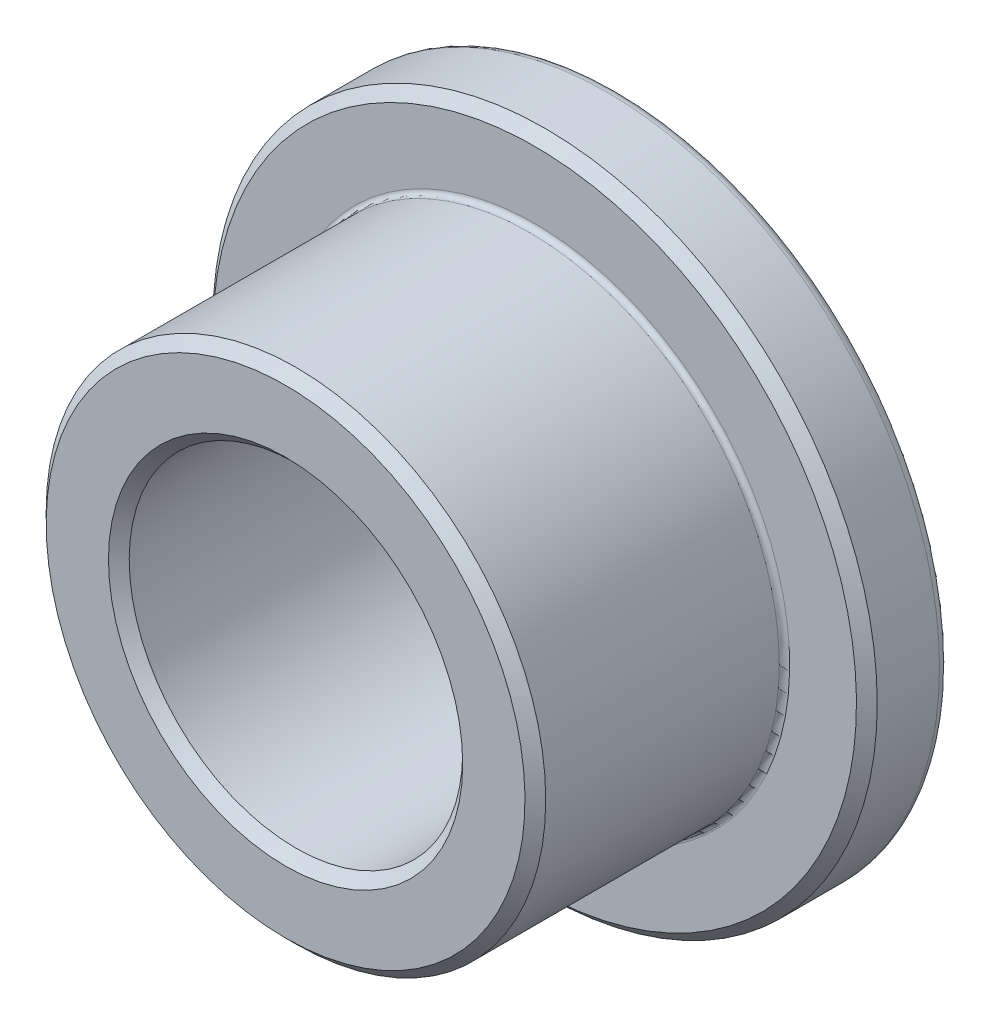
ISO-10303-21;
HEADER;
FILE_DESCRIPTION(('STEP AP214'),'2;1');
FILE_NAME('part.step','',(''),(''),'','','');
FILE_SCHEMA(('AUTOMOTIVE_DESIGN { 1 0 10303 214 1 1 1 1 }'));
ENDSEC;
DATA;
#1=APPLICATION_CONTEXT('core data for automotive mechanical design processes');
#2=APPLICATION_PROTOCOL_DEFINITION('international standard','automotive_design',2000,#1);
#3=PRODUCT_CONTEXT('',#1,'mechanical');
#4=PRODUCT('Part','Part','',(#3));
#5=PRODUCT_RELATED_PRODUCT_CATEGORY('part','',(#4));
#6=PRODUCT_DEFINITION_FORMATION('','',#4);
#7=PRODUCT_DEFINITION_CONTEXT('part definition',#1,'design');
#8=PRODUCT_DEFINITION('design','',#6,#7);
#9=PRODUCT_DEFINITION_SHAPE('','',#8);
#10=(LENGTH_UNIT() NAMED_UNIT(*) SI_UNIT(.MILLI.,.METRE.));
#11=(NAMED_UNIT(*) PLANE_ANGLE_UNIT() SI_UNIT($,.RADIAN.));
#12=(NAMED_UNIT(*) SI_UNIT($,.STERADIAN.) SOLID_ANGLE_UNIT());
#13=UNCERTAINTY_MEASURE_WITH_UNIT(LENGTH_MEASURE(1.E-05),#10,'distance_accuracy_value','');
#14=(GEOMETRIC_REPRESENTATION_CONTEXT(3) GLOBAL_UNCERTAINTY_ASSIGNED_CONTEXT((#13)) GLOBAL_UNIT_ASSIGNED_CONTEXT((#10,
#11,#12)) REPRESENTATION_CONTEXT('',''));
#15=CARTESIAN_POINT('',(0.,0.,0.));
#16=DIRECTION('',(0.,0.,1.));
#17=DIRECTION('',(1.,0.,0.));
#18=AXIS2_PLACEMENT_3D('',#15,#16,#17);
#19=CARTESIAN_POINT('',(0.,6.35,-3.175));
#20=DIRECTION('',(0.,0.,-1.));
#21=DIRECTION('',(0.,1.,0.));
#22=AXIS2_PLACEMENT_3D('',#19,#20,#21);
#23=PLANE('',#22);
#24=CARTESIAN_POINT('',(0.,0.,-3.175));
#25=DIRECTION('',(0.,0.,-1.));
#26=DIRECTION('',(0.,1.,0.));
#27=AXIS2_PLACEMENT_3D('',#24,#25,#26);
#28=CIRCLE('',#27,6.1515625);
#29=CARTESIAN_POINT('',(0.,6.1515625,-3.175));
#30=VERTEX_POINT('',#29);
#31=EDGE_CURVE('E47',#30,#30,#28,.T.);
#32=ORIENTED_EDGE('',*,*,#31,.T.);
#33=EDGE_LOOP('',(#32));
#34=FACE_BOUND('',#33,.T.);
#35=CARTESIAN_POINT('',(0.,0.,-3.175));
#36=DIRECTION('',(0.,0.,-1.));
#37=DIRECTION('',(0.,1.,0.));
#38=AXIS2_PLACEMENT_3D('',#35,#36,#37);
#39=CIRCLE('',#38,3.1877);
#40=CARTESIAN_POINT('',(0.,3.1877,-3.175));
#41=VERTEX_POINT('',#40);
#42=EDGE_CURVE('E70',#41,#41,#39,.T.);
#43=ORIENTED_EDGE('',*,*,#42,.F.);
#44=EDGE_LOOP('',(#43));
#45=FACE_BOUND('',#44,.T.);
#46=ADVANCED_FACE('F32',(#34,#45),#23,.T.);
#47=CARTESIAN_POINT('',(0.,0.,-3.175));
#48=DIRECTION('',(0.,0.,-1.));
#49=DIRECTION('',(0.,1.,0.));
#50=AXIS2_PLACEMENT_3D('',#47,#48,#49);
#51=CYLINDRICAL_SURFACE('',#50,6.35);
#52=CARTESIAN_POINT('',(0.,0.,-2.9765625));
#53=DIRECTION('',(0.,0.,-1.));
#54=DIRECTION('',(0.,1.,0.));
#55=AXIS2_PLACEMENT_3D('',#52,#53,#54);
#56=CIRCLE('',#55,6.35);
#57=CARTESIAN_POINT('',(0.,6.35,-2.9765625));
#58=VERTEX_POINT('',#57);
#59=EDGE_CURVE('E43',#58,#58,#56,.F.);
#60=ORIENTED_EDGE('',*,*,#59,.T.);
#61=EDGE_LOOP('',(#60));
#62=FACE_BOUND('',#61,.T.);
#63=CARTESIAN_POINT('',(0.,0.,-1.7859375));
#64=DIRECTION('',(0.,0.,1.));
#65=DIRECTION('',(0.,-1.,0.));
#66=AXIS2_PLACEMENT_3D('',#63,#64,#65);
#67=CIRCLE('',#66,6.35);
#68=CARTESIAN_POINT('',(0.,-6.35,-1.78593750000001));
#69=VERTEX_POINT('',#68);
#70=EDGE_CURVE('E67',#69,#69,#67,.F.);
#71=ORIENTED_EDGE('',*,*,#70,.T.);
#72=EDGE_LOOP('',(#71));
#73=FACE_BOUND('',#72,.T.);
#74=ADVANCED_FACE('F77',(#62,#73),#51,.T.);
#75=CARTESIAN_POINT('',(0.,6.35,-1.5875));
#76=DIRECTION('',(0.,0.,1.));
#77=DIRECTION('',(0.,-1.,0.));
#78=AXIS2_PLACEMENT_3D('',#75,#76,#77);
#79=PLANE('',#78);
#80=CARTESIAN_POINT('',(0.,0.,-1.5875));
#81=DIRECTION('',(0.,0.,1.));
#82=DIRECTION('',(0.,-1.,0.));
#83=AXIS2_PLACEMENT_3D('',#80,#81,#82);
#84=CIRCLE('',#83,4.87441875);
#85=CARTESIAN_POINT('',(0.,-4.87441875,-1.5875));
#86=VERTEX_POINT('',#85);
#87=EDGE_CURVE('E39',#86,#86,#84,.F.);
#88=ORIENTED_EDGE('',*,*,#87,.T.);
#89=EDGE_LOOP('',(#88));
#90=FACE_BOUND('',#89,.T.);
#91=CARTESIAN_POINT('',(0.,0.,-1.5875));
#92=DIRECTION('',(0.,0.,1.));
#93=DIRECTION('',(0.,-1.,0.));
#94=AXIS2_PLACEMENT_3D('',#91,#92,#93);
#95=CIRCLE('',#94,6.15156249999999);
#96=CARTESIAN_POINT('',(0.,-6.15156249999999,-1.5875));
#97=VERTEX_POINT('',#96);
#98=EDGE_CURVE('E64',#97,#97,#95,.T.);
#99=ORIENTED_EDGE('',*,*,#98,.T.);
#100=EDGE_LOOP('',(#99));
#101=FACE_BOUND('',#100,.T.);
#102=ADVANCED_FACE('F83',(#90,#101),#79,.T.);
#103=CARTESIAN_POINT('',(0.,0.,-3.175));
#104=DIRECTION('',(0.,0.,-1.));
#105=DIRECTION('',(0.,1.,0.));
#106=AXIS2_PLACEMENT_3D('',#103,#104,#105);
#107=CYLINDRICAL_SURFACE('',#106,4.7752);
#108=CARTESIAN_POINT('',(0.,0.,-1.48828125));
#109=DIRECTION('',(0.,0.,1.));
#110=DIRECTION('',(0.,-1.,0.));
#111=AXIS2_PLACEMENT_3D('',#108,#109,#110);
#112=CIRCLE('',#111,4.7752);
#113=CARTESIAN_POINT('',(0.,-4.7752,-1.48828125));
#114=VERTEX_POINT('',#113);
#115=EDGE_CURVE('E10',#114,#114,#112,.T.);
#116=ORIENTED_EDGE('',*,*,#115,.T.);
#117=EDGE_LOOP('',(#116));
#118=FACE_BOUND('',#117,.T.);
#119=CARTESIAN_POINT('',(0.,0.,2.9765625));
#120=DIRECTION('',(0.,0.,1.));
#121=DIRECTION('',(0.,-1.,0.));
#122=AXIS2_PLACEMENT_3D('',#119,#120,#121);
#123=CIRCLE('',#122,4.7752);
#124=CARTESIAN_POINT('',(0.,-4.7752,2.9765625));
#125=VERTEX_POINT('',#124);
#126=EDGE_CURVE('E61',#125,#125,#123,.F.);
#127=ORIENTED_EDGE('',*,*,#126,.T.);
#128=EDGE_LOOP('',(#127));
#129=FACE_BOUND('',#128,.T.);
#130=ADVANCED_FACE('F121',(#118,#129),#107,.T.);
#131=CARTESIAN_POINT('',(0.,4.7752,3.175));
#132=DIRECTION('',(0.,0.,1.));
#133=DIRECTION('',(0.,-1.,0.));
#134=AXIS2_PLACEMENT_3D('',#131,#132,#133);
#135=PLANE('',#134);
#136=CARTESIAN_POINT('',(0.,0.,3.175));
#137=DIRECTION('',(0.,0.,1.));
#138=DIRECTION('',(0.,-1.,0.));
#139=AXIS2_PLACEMENT_3D('',#136,#137,#138);
#140=CIRCLE('',#139,4.5767625);
#141=CARTESIAN_POINT('',(0.,-4.5767625,3.175));
#142=VERTEX_POINT('',#141);
#143=EDGE_CURVE('E55',#142,#142,#140,.T.);
#144=ORIENTED_EDGE('',*,*,#143,.T.);
#145=EDGE_LOOP('',(#144));
#146=FACE_BOUND('',#145,.T.);
#147=CARTESIAN_POINT('',(0.,0.,3.175));
#148=DIRECTION('',(0.,0.,1.));
#149=DIRECTION('',(0.,-1.,0.));
#150=AXIS2_PLACEMENT_3D('',#147,#148,#149);
#151=CIRCLE('',#150,3.38613749999999);
#152=CARTESIAN_POINT('',(0.,-3.38613749999999,3.175));
#153=VERTEX_POINT('',#152);
#154=EDGE_CURVE('E58',#153,#153,#151,.F.);
#155=ORIENTED_EDGE('',*,*,#154,.T.);
#156=EDGE_LOOP('',(#155));
#157=FACE_BOUND('',#156,.T.);
#158=ADVANCED_FACE('F126',(#146,#157),#135,.T.);
#159=CARTESIAN_POINT('',(0.,0.,-3.175));
#160=DIRECTION('',(0.,0.,-1.));
#161=DIRECTION('',(0.,1.,0.));
#162=AXIS2_PLACEMENT_3D('',#159,#160,#161);
#163=CYLINDRICAL_SURFACE('',#162,3.1877);
#164=CARTESIAN_POINT('',(0.,0.,2.9765625));
#165=DIRECTION('',(0.,0.,1.));
#166=DIRECTION('',(0.,-1.,0.));
#167=AXIS2_PLACEMENT_3D('',#164,#165,#166);
#168=CIRCLE('',#167,3.1877);
#169=CARTESIAN_POINT('',(0.,-3.1877,2.9765625));
#170=VERTEX_POINT('',#169);
#171=EDGE_CURVE('E52',#170,#170,#168,.T.);
#172=ORIENTED_EDGE('',*,*,#171,.T.);
#173=EDGE_LOOP('',(#172));
#174=FACE_BOUND('',#173,.T.);
#175=ORIENTED_EDGE('',*,*,#42,.T.);
#176=EDGE_LOOP('',(#175));
#177=FACE_BOUND('',#176,.T.);
#178=ADVANCED_FACE('F74',(#174,#177),#163,.F.);
#179=CARTESIAN_POINT('',(0.,0.,-1.7859375));
#180=DIRECTION('',(0.,0.,-1.));
#181=DIRECTION('',(0.,1.,0.));
#182=AXIS2_PLACEMENT_3D('',#179,#180,#181);
#183=CONICAL_SURFACE('',#182,6.35,0.785398163397453);
#184=ORIENTED_EDGE('',*,*,#98,.F.);
#185=EDGE_LOOP('',(#184));
#186=FACE_BOUND('',#185,.T.);
#187=ORIENTED_EDGE('',*,*,#70,.F.);
#188=EDGE_LOOP('',(#187));
#189=FACE_BOUND('',#188,.T.);
#190=ADVANCED_FACE('F88',(#186,#189),#183,.T.);
#191=CARTESIAN_POINT('',(0.,0.,2.9765625));
#192=DIRECTION('',(0.,0.,-1.));
#193=DIRECTION('',(0.,1.,0.));
#194=AXIS2_PLACEMENT_3D('',#191,#192,#193);
#195=CONICAL_SURFACE('',#194,4.7752,0.78539816339745);
#196=ORIENTED_EDGE('',*,*,#143,.F.);
#197=EDGE_LOOP('',(#196));
#198=FACE_BOUND('',#197,.T.);
#199=ORIENTED_EDGE('',*,*,#126,.F.);
#200=EDGE_LOOP('',(#199));
#201=FACE_BOUND('',#200,.T.);
#202=ADVANCED_FACE('F91',(#198,#201),#195,.T.);
#203=CARTESIAN_POINT('',(0.,0.,3.175));
#204=DIRECTION('',(0.,0.,1.));
#205=DIRECTION('',(0.,-1.,0.));
#206=AXIS2_PLACEMENT_3D('',#203,#204,#205);
#207=CONICAL_SURFACE('',#206,3.38613749999999,0.785398163397447);
#208=ORIENTED_EDGE('',*,*,#171,.F.);
#209=EDGE_LOOP('',(#208));
#210=FACE_BOUND('',#209,.T.);
#211=ORIENTED_EDGE('',*,*,#154,.F.);
#212=EDGE_LOOP('',(#211));
#213=FACE_BOUND('',#212,.T.);
#214=ADVANCED_FACE('F95',(#210,#213),#207,.F.);
#215=CARTESIAN_POINT('',(0.,0.,-2.9765625));
#216=DIRECTION('',(0.,0.,-1.));
#217=DIRECTION('',(0.,1.,0.));
#218=AXIS2_PLACEMENT_3D('',#215,#216,#217);
#219=TOROIDAL_SURFACE('',#218,6.1515625,0.1984375);
#220=ORIENTED_EDGE('',*,*,#59,.F.);
#221=EDGE_LOOP('',(#220));
#222=FACE_BOUND('',#221,.T.);
#223=ORIENTED_EDGE('',*,*,#31,.F.);
#224=EDGE_LOOP('',(#223));
#225=FACE_BOUND('',#224,.T.);
#226=ADVANCED_FACE('F98',(#222,#225),#219,.T.);
#227=CARTESIAN_POINT('',(0.,0.,-1.48828125));
#228=DIRECTION('',(0.,0.,1.));
#229=DIRECTION('',(0.,-1.,0.));
#230=AXIS2_PLACEMENT_3D('',#227,#228,#229);
#231=TOROIDAL_SURFACE('',#230,4.87441875,0.09921875);
#232=ORIENTED_EDGE('',*,*,#115,.F.);
#233=EDGE_LOOP('',(#232));
#234=FACE_BOUND('',#233,.T.);
#235=ORIENTED_EDGE('',*,*,#87,.F.);
#236=EDGE_LOOP('',(#235));
#237=FACE_BOUND('',#236,.T.);
#238=ADVANCED_FACE('F34',(#234,#237),#231,.F.);
#239=CLOSED_SHELL('',(#46,#74,#102,#130,#158,#178,#190,#202,#214,#226,#238));
#240=MANIFOLD_SOLID_BREP('B2',#239);
#241=ADVANCED_BREP_SHAPE_REPRESENTATION('',(#18,#240),#14);
#242=SHAPE_DEFINITION_REPRESENTATION(#9,#241);
ENDSEC;
END-ISO-10303-21;
